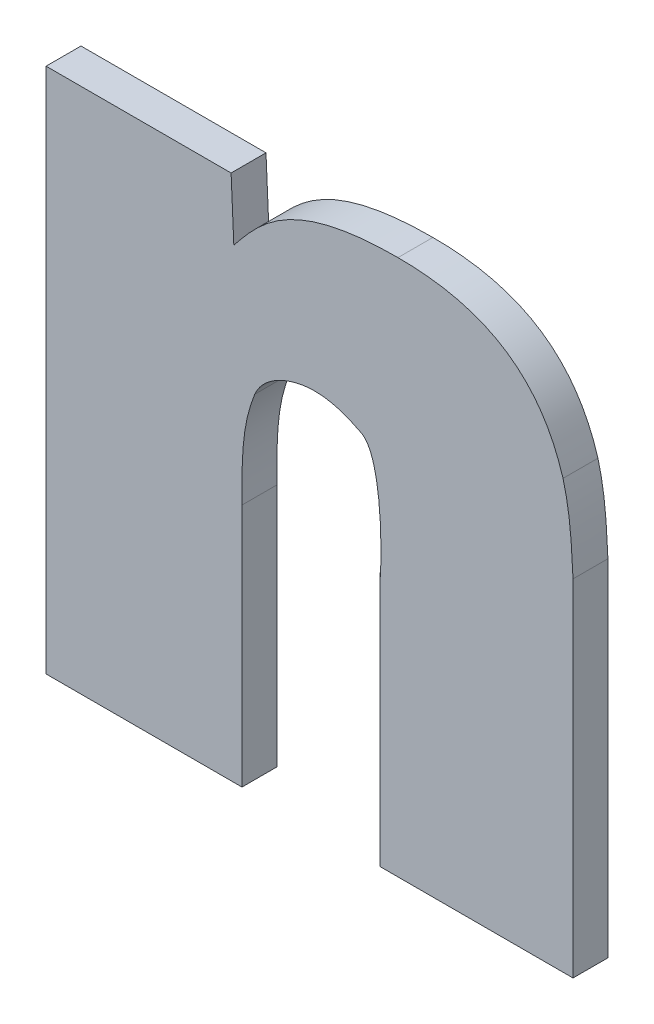
ISO-10303-21;
HEADER;
FILE_DESCRIPTION(('STEP AP214'),'2;1');
FILE_NAME('part.step','',(''),(''),'','','');
FILE_SCHEMA(('AUTOMOTIVE_DESIGN { 1 0 10303 214 1 1 1 1 }'));
ENDSEC;
DATA;
#1=APPLICATION_CONTEXT('core data for automotive mechanical design processes');
#2=APPLICATION_PROTOCOL_DEFINITION('international standard','automotive_design',2000,#1);
#3=PRODUCT_CONTEXT('',#1,'mechanical');
#4=PRODUCT('Part','Part','',(#3));
#5=PRODUCT_RELATED_PRODUCT_CATEGORY('part','',(#4));
#6=PRODUCT_DEFINITION_FORMATION('','',#4);
#7=PRODUCT_DEFINITION_CONTEXT('part definition',#1,'design');
#8=PRODUCT_DEFINITION('design','',#6,#7);
#9=PRODUCT_DEFINITION_SHAPE('','',#8);
#10=(LENGTH_UNIT() NAMED_UNIT(*) SI_UNIT(.MILLI.,.METRE.));
#11=(NAMED_UNIT(*) PLANE_ANGLE_UNIT() SI_UNIT($,.RADIAN.));
#12=(NAMED_UNIT(*) SI_UNIT($,.STERADIAN.) SOLID_ANGLE_UNIT());
#13=UNCERTAINTY_MEASURE_WITH_UNIT(LENGTH_MEASURE(1.E-05),#10,'distance_accuracy_value','');
#14=(GEOMETRIC_REPRESENTATION_CONTEXT(3) GLOBAL_UNCERTAINTY_ASSIGNED_CONTEXT((#13)) GLOBAL_UNIT_ASSIGNED_CONTEXT((#10,
#11,#12)) REPRESENTATION_CONTEXT('',''));
#15=CARTESIAN_POINT('',(0.,0.,0.));
#16=DIRECTION('',(0.,0.,1.));
#17=DIRECTION('',(1.,0.,0.));
#18=AXIS2_PLACEMENT_3D('',#15,#16,#17);
#19=CARTESIAN_POINT('',(-0.00274224861585553,-0.192058480014889,0.));
#20=DIRECTION('',(-1.,0.,0.));
#21=DIRECTION('',(0.,-1.,0.));
#22=AXIS2_PLACEMENT_3D('',#19,#20,#21);
#23=PLANE('',#22);
#24=DIRECTION('',(0.,-1.,0.));
#25=VECTOR('',#24,1.);
#26=CARTESIAN_POINT('',(-0.00274224861585553,-0.192058480014889,0.));
#27=LINE('',#26,#25);
#28=CARTESIAN_POINT('',(-0.00274224861585553,-0.192058480014889,0.));
#29=VERTEX_POINT('',#28);
#30=CARTESIAN_POINT('',(-0.00274224861585553,-0.213912842174517,0.));
#31=VERTEX_POINT('',#30);
#32=EDGE_CURVE('E11',#29,#31,#27,.T.);
#33=ORIENTED_EDGE('',*,*,#32,.T.);
#34=DIRECTION('',(0.,0.,1.));
#35=VECTOR('',#34,1.);
#36=CARTESIAN_POINT('',(-0.00274224861585553,-0.213912842174517,0.));
#37=LINE('',#36,#35);
#38=CARTESIAN_POINT('',(-0.00274224861585553,-0.213912842174517,0.003));
#39=VERTEX_POINT('',#38);
#40=EDGE_CURVE('E24',#31,#39,#37,.T.);
#41=ORIENTED_EDGE('',*,*,#40,.T.);
#42=DIRECTION('',(0.,-1.,0.));
#43=VECTOR('',#42,1.);
#44=CARTESIAN_POINT('',(-0.00274224861585553,-0.192058480014889,0.003));
#45=LINE('',#44,#43);
#46=CARTESIAN_POINT('',(-0.00274224861585553,-0.192058480014889,0.003));
#47=VERTEX_POINT('',#46);
#48=EDGE_CURVE('E142',#47,#39,#45,.T.);
#49=ORIENTED_EDGE('',*,*,#48,.F.);
#50=DIRECTION('',(0.,0.,1.));
#51=VECTOR('',#50,1.);
#52=CARTESIAN_POINT('',(-0.00274224861585553,-0.192058480014889,0.));
#53=LINE('',#52,#51);
#54=EDGE_CURVE('E318',#29,#47,#53,.T.);
#55=ORIENTED_EDGE('',*,*,#54,.F.);
#56=EDGE_LOOP('',(#33,#41,#49,#55));
#57=FACE_BOUND('',#56,.T.);
#58=ADVANCED_FACE('F17',(#57),#23,.T.);
#59=CARTESIAN_POINT('',(-0.00437898165124764,-0.182425098499369,0.));
#60=CARTESIAN_POINT('',(-0.00437898165124764,-0.182425098499369,0.003));
#61=CARTESIAN_POINT('',(-0.00204079567022111,-0.183524051232402,0.));
#62=CARTESIAN_POINT('',(-0.00204079567022111,-0.183524051232402,0.003));
#63=CARTESIAN_POINT('',(-0.00274224737452582,-0.194661669216421,0.));
#64=CARTESIAN_POINT('',(-0.00274224737452582,-0.194661669216421,0.003));
#65=CARTESIAN_POINT('',(-0.00274224861585553,-0.192058480014889,0.));
#66=CARTESIAN_POINT('',(-0.00274224861585553,-0.192058480014889,0.003));
#67=B_SPLINE_SURFACE_WITH_KNOTS('',3,1,((#59,#60),(#61,#62),(#63,#64),(#65,#66)),.UNSPECIFIED.,
.F.,.F.,.F.,(4,4),(2,2),(0.,1.),(0.,0.0003),.UNSPECIFIED.);
#68=CARTESIAN_POINT('',(-0.00437898165124764,-0.182425098499369,0.));
#69=CARTESIAN_POINT('',(-0.00204079567022111,-0.183524051232402,0.));
#70=CARTESIAN_POINT('',(-0.00274224737452582,-0.194661669216421,0.));
#71=CARTESIAN_POINT('',(-0.00274224861585553,-0.192058480014889,0.));
#72=B_SPLINE_CURVE_WITH_KNOTS('',3,(#68,#69,#70,#71),.UNSPECIFIED.,.F.,.F.,(4,4),(0.,1.),.UNSPECIFIED.);
#73=CARTESIAN_POINT('',(-0.00437898165124764,-0.182425098499369,0.));
#74=VERTEX_POINT('',#73);
#75=EDGE_CURVE('E310',#74,#29,#72,.T.);
#76=CARTESIAN_POINT('',(-0.00437898165124764,-0.182425098499369,0.003));
#77=CARTESIAN_POINT('',(-0.00204079567022111,-0.183524051232402,0.003));
#78=CARTESIAN_POINT('',(-0.00274224737452582,-0.194661669216421,0.003));
#79=CARTESIAN_POINT('',(-0.00274224861585553,-0.192058480014889,0.003));
#80=B_SPLINE_CURVE_WITH_KNOTS('',3,(#76,#77,#78,#79),.UNSPECIFIED.,.F.,.F.,(4,4),(0.,1.),.UNSPECIFIED.);
#81=CARTESIAN_POINT('',(-0.00437898165124764,-0.182425098499369,0.003));
#82=VERTEX_POINT('',#81);
#83=EDGE_CURVE('E306',#82,#47,#80,.T.);
#84=DIRECTION('',(0.,0.,1.));
#85=VECTOR('',#84,1.);
#86=CARTESIAN_POINT('',(-0.00437898165124764,-0.182425098499369,0.));
#87=LINE('',#86,#85);
#88=EDGE_CURVE('E300',#74,#82,#87,.T.);
#89=CARTESIAN_POINT('',(-0.00437898165124764,-0.182425098499369,0.));
#90=CARTESIAN_POINT('',(-0.00437898165124764,-0.182425098499369,0.003));
#91=CARTESIAN_POINT('',(-0.00204079567022111,-0.183524051232402,0.));
#92=CARTESIAN_POINT('',(-0.00204079567022111,-0.183524051232402,0.003));
#93=CARTESIAN_POINT('',(-0.00274224737452582,-0.194661669216421,0.));
#94=CARTESIAN_POINT('',(-0.00274224737452582,-0.194661669216421,0.003));
#95=CARTESIAN_POINT('',(-0.00274224861585553,-0.192058480014889,0.));
#96=CARTESIAN_POINT('',(-0.00274224861585553,-0.192058480014889,0.003));
#97=CARTESIAN_POINT('',(-0.00274224872260989,-0.191834605743557,0.));
#98=CARTESIAN_POINT('',(-0.00274224872260989,-0.191834605743557,0.003));
#99=CARTESIAN_POINT('',(-0.00274224882936424,-0.191610731472225,0.));
#100=CARTESIAN_POINT('',(-0.00274224882936424,-0.191610731472225,0.003));
#101=CARTESIAN_POINT('',(-0.0027422489361186,-0.191386857200894,0.));
#102=CARTESIAN_POINT('',(-0.0027422489361186,-0.191386857200894,0.003));
#103=B_SPLINE_SURFACE_WITH_KNOTS('',3,1,((#89,#90),(#91,#92),(#93,#94),(#95,#96),(#97,#98),(#99,
#100),(#101,#102)),.UNSPECIFIED.,.F.,.F.,.F.,(4,3,4),(2,2),(0.,1.,1.086),(0.,0.0003),.UNSPECIFIED.);
#104=ORIENTED_EDGE('',*,*,#75,.T.);
#105=ORIENTED_EDGE('',*,*,#54,.T.);
#106=ORIENTED_EDGE('',*,*,#83,.F.);
#107=ORIENTED_EDGE('',*,*,#88,.F.);
#108=EDGE_LOOP('',(#104,#105,#106,#107));
#109=FACE_BOUND('',#108,.T.);
#110=ADVANCED_FACE('F359',(#109),#103,.T.);
#111=CARTESIAN_POINT('',(-0.00843186579844759,-0.181326156128297,0.));
#112=CARTESIAN_POINT('',(-0.00843186579844759,-0.181326156128297,0.003));
#113=CARTESIAN_POINT('',(-0.00663925627399071,-0.181287178579809,0.));
#114=CARTESIAN_POINT('',(-0.00663925627399071,-0.181287178579809,0.003));
#115=CARTESIAN_POINT('',(-0.0051583846387041,-0.182043194470393,0.));
#116=CARTESIAN_POINT('',(-0.0051583846387041,-0.182043194470393,0.003));
#117=CARTESIAN_POINT('',(-0.00437898165124764,-0.182425098499369,0.));
#118=CARTESIAN_POINT('',(-0.00437898165124764,-0.182425098499369,0.003));
#119=B_SPLINE_SURFACE_WITH_KNOTS('',3,1,((#111,#112),(#113,#114),(#115,#116),(#117,#118)),
.UNSPECIFIED.,.F.,.F.,.F.,(4,4),(2,2),(0.,1.),(0.,0.0003),.UNSPECIFIED.);
#120=CARTESIAN_POINT('',(-0.00843186579844759,-0.181326156128297,0.));
#121=CARTESIAN_POINT('',(-0.00663925627399071,-0.181287178579809,0.));
#122=CARTESIAN_POINT('',(-0.0051583846387041,-0.182043194470393,0.));
#123=CARTESIAN_POINT('',(-0.00437898165124764,-0.182425098499369,0.));
#124=B_SPLINE_CURVE_WITH_KNOTS('',3,(#120,#121,#122,#123),.UNSPECIFIED.,.F.,.F.,(4,4),(0.,1.),.UNSPECIFIED.);
#125=CARTESIAN_POINT('',(-0.00843186579844759,-0.181326156128297,0.));
#126=VERTEX_POINT('',#125);
#127=EDGE_CURVE('E292',#126,#74,#124,.T.);
#128=CARTESIAN_POINT('',(-0.00843186579844759,-0.181326156128297,0.003));
#129=CARTESIAN_POINT('',(-0.00663925627399071,-0.181287178579809,0.003));
#130=CARTESIAN_POINT('',(-0.0051583846387041,-0.182043194470393,0.003));
#131=CARTESIAN_POINT('',(-0.00437898165124764,-0.182425098499369,0.003));
#132=B_SPLINE_CURVE_WITH_KNOTS('',3,(#128,#129,#130,#131),.UNSPECIFIED.,.F.,.F.,(4,4),(0.,1.),.UNSPECIFIED.);
#133=CARTESIAN_POINT('',(-0.00843186579844759,-0.181326156128297,0.003));
#134=VERTEX_POINT('',#133);
#135=EDGE_CURVE('E287',#134,#82,#132,.T.);
#136=DIRECTION('',(0.,0.,1.));
#137=VECTOR('',#136,1.);
#138=CARTESIAN_POINT('',(-0.00843186579844759,-0.181326156128297,0.));
#139=LINE('',#138,#137);
#140=EDGE_CURVE('E281',#126,#134,#139,.T.);
#141=ORIENTED_EDGE('',*,*,#127,.T.);
#142=ORIENTED_EDGE('',*,*,#88,.T.);
#143=ORIENTED_EDGE('',*,*,#135,.F.);
#144=ORIENTED_EDGE('',*,*,#140,.F.);
#145=EDGE_LOOP('',(#141,#142,#143,#144));
#146=FACE_BOUND('',#145,.T.);
#147=ADVANCED_FACE('F356',(#146),#119,.T.);
#148=CARTESIAN_POINT('',(-0.0134979656342683,-0.184147574261929,0.));
#149=CARTESIAN_POINT('',(-0.0134979656342683,-0.184147574261929,0.003));
#150=CARTESIAN_POINT('',(-0.0133130729557002,-0.183720514151418,0.));
#151=CARTESIAN_POINT('',(-0.0133130729557002,-0.183720514151418,0.003));
#152=CARTESIAN_POINT('',(-0.0130453320812846,-0.183340541159043,0.));
#153=CARTESIAN_POINT('',(-0.0130453320812846,-0.183340541159043,0.003));
#154=CARTESIAN_POINT('',(-0.0123851302839423,-0.182669788078298,0.));
#155=CARTESIAN_POINT('',(-0.0123851302839423,-0.182669788078298,0.003));
#156=CARTESIAN_POINT('',(-0.011994902994516,-0.182386006466949,0.));
#157=CARTESIAN_POINT('',(-0.011994902994516,-0.182386006466949,0.003));
#158=CARTESIAN_POINT('',(-0.0111007810286606,-0.181889367272901,0.));
#159=CARTESIAN_POINT('',(-0.0111007810286606,-0.181889367272901,0.003));
#160=CARTESIAN_POINT('',(-0.0105801356724161,-0.181688465209944,0.));
#161=CARTESIAN_POINT('',(-0.0105801356724161,-0.181688465209944,0.003));
#162=CARTESIAN_POINT('',(-0.00952439418704317,-0.181414383581828,0.));
#163=CARTESIAN_POINT('',(-0.00952439418704317,-0.181414383581828,0.003));
#164=CARTESIAN_POINT('',(-0.00897466285186775,-0.181336594439367,0.));
#165=CARTESIAN_POINT('',(-0.00897466285186775,-0.181336594439367,0.003));
#166=CARTESIAN_POINT('',(-0.00843186579844759,-0.181326156128297,0.));
#167=CARTESIAN_POINT('',(-0.00843186579844759,-0.181326156128297,0.003));
#168=B_SPLINE_SURFACE_WITH_KNOTS('',3,1,((#148,#149),(#150,#151),(#152,#153),(#154,#155),(#156,
#157),(#158,#159),(#160,#161),(#162,#163),(#164,#165),(#166,#167)),.UNSPECIFIED.,.F.,.F.,.F.,(4,
2,2,2,4),(2,2),(0.,0.0010389354432012,0.0021009182741266,0.003320279666233,0.004532104245712),
(0.,0.0003),.UNSPECIFIED.);
#169=CARTESIAN_POINT('',(-0.0134979656342683,-0.184147574261929,0.));
#170=CARTESIAN_POINT('',(-0.0133130729557002,-0.183720514151418,0.));
#171=CARTESIAN_POINT('',(-0.0130453320812846,-0.183340541159043,0.));
#172=CARTESIAN_POINT('',(-0.0123851302839423,-0.182669788078298,0.));
#173=CARTESIAN_POINT('',(-0.011994902994516,-0.182386006466949,0.));
#174=CARTESIAN_POINT('',(-0.0111007810286606,-0.181889367272901,0.));
#175=CARTESIAN_POINT('',(-0.0105801356724161,-0.181688465209944,0.));
#176=CARTESIAN_POINT('',(-0.00952439418704317,-0.181414383581828,0.));
#177=CARTESIAN_POINT('',(-0.00897466285186775,-0.181336594439367,0.));
#178=CARTESIAN_POINT('',(-0.00843186579844759,-0.181326156128297,0.));
#179=B_SPLINE_CURVE_WITH_KNOTS('',3,(#169,#170,#171,#172,#173,#174,#175,#176,#177,#178),
.UNSPECIFIED.,.F.,.F.,(4,2,2,2,4),(0.,0.0010389354432012,0.0021009182741266,0.003320279666233,
0.004532104245712),.UNSPECIFIED.);
#180=CARTESIAN_POINT('',(-0.0134979656342683,-0.184147574261929,0.));
#181=VERTEX_POINT('',#180);
#182=EDGE_CURVE('E273',#181,#126,#179,.T.);
#183=CARTESIAN_POINT('',(-0.0134979656342683,-0.184147574261929,0.003));
#184=CARTESIAN_POINT('',(-0.0133130729557002,-0.183720514151418,0.003));
#185=CARTESIAN_POINT('',(-0.0130453320812846,-0.183340541159043,0.003));
#186=CARTESIAN_POINT('',(-0.0123851302839423,-0.182669788078298,0.003));
#187=CARTESIAN_POINT('',(-0.011994902994516,-0.182386006466949,0.003));
#188=CARTESIAN_POINT('',(-0.0111007810286606,-0.181889367272901,0.003));
#189=CARTESIAN_POINT('',(-0.0105801356724161,-0.181688465209944,0.003));
#190=CARTESIAN_POINT('',(-0.00952439418704317,-0.181414383581828,0.003));
#191=CARTESIAN_POINT('',(-0.00897466285186775,-0.181336594439367,0.003));
#192=CARTESIAN_POINT('',(-0.00843186579844759,-0.181326156128297,0.003));
#193=B_SPLINE_CURVE_WITH_KNOTS('',3,(#183,#184,#185,#186,#187,#188,#189,#190,#191,#192),
.UNSPECIFIED.,.F.,.F.,(4,2,2,2,4),(0.,0.0010389354432012,0.0021009182741266,0.003320279666233,
0.004532104245712),.UNSPECIFIED.);
#194=CARTESIAN_POINT('',(-0.0134979656342683,-0.184147574261929,0.003));
#195=VERTEX_POINT('',#194);
#196=EDGE_CURVE('E268',#195,#134,#193,.T.);
#197=DIRECTION('',(0.,0.,1.));
#198=VECTOR('',#197,1.);
#199=CARTESIAN_POINT('',(-0.0134979656342683,-0.184147574261929,0.));
#200=LINE('',#199,#198);
#201=EDGE_CURVE('E262',#181,#195,#200,.T.);
#202=ORIENTED_EDGE('',*,*,#182,.T.);
#203=ORIENTED_EDGE('',*,*,#140,.T.);
#204=ORIENTED_EDGE('',*,*,#196,.F.);
#205=ORIENTED_EDGE('',*,*,#201,.F.);
#206=EDGE_LOOP('',(#202,#203,#204,#205));
#207=FACE_BOUND('',#206,.T.);
#208=ADVANCED_FACE('F353',(#207),#168,.T.);
#209=CARTESIAN_POINT('',(-0.0145891316876444,-0.192939204150313,0.));
#210=CARTESIAN_POINT('',(-0.0145891316876444,-0.192939204150313,0.003));
#211=CARTESIAN_POINT('',(-0.0146670499630458,-0.188364119411759,0.));
#212=CARTESIAN_POINT('',(-0.0146670499630458,-0.188364119411759,0.003));
#213=CARTESIAN_POINT('',(-0.014355312682584,-0.186345480396953,0.));
#214=CARTESIAN_POINT('',(-0.014355312682584,-0.186345480396953,0.003));
#215=CARTESIAN_POINT('',(-0.0134979656342683,-0.184147574261929,0.));
#216=CARTESIAN_POINT('',(-0.0134979656342683,-0.184147574261929,0.003));
#217=B_SPLINE_SURFACE_WITH_KNOTS('',3,1,((#209,#210),(#211,#212),(#213,#214),(#215,#216)),
.UNSPECIFIED.,.F.,.F.,.F.,(4,4),(2,2),(0.,1.),(0.,0.0003),.UNSPECIFIED.);
#218=CARTESIAN_POINT('',(-0.0145891316876444,-0.192939204150313,0.));
#219=CARTESIAN_POINT('',(-0.0146670499630458,-0.188364119411759,0.));
#220=CARTESIAN_POINT('',(-0.014355312682584,-0.186345480396953,0.));
#221=CARTESIAN_POINT('',(-0.0134979656342683,-0.184147574261929,0.));
#222=B_SPLINE_CURVE_WITH_KNOTS('',3,(#218,#219,#220,#221),.UNSPECIFIED.,.F.,.F.,(4,4),(0.,1.),.UNSPECIFIED.);
#223=CARTESIAN_POINT('',(-0.0145891316876444,-0.192939204150313,0.));
#224=VERTEX_POINT('',#223);
#225=EDGE_CURVE('E254',#224,#181,#222,.T.);
#226=CARTESIAN_POINT('',(-0.0145891316876444,-0.192939204150313,0.003));
#227=CARTESIAN_POINT('',(-0.0146670499630458,-0.188364119411759,0.003));
#228=CARTESIAN_POINT('',(-0.014355312682584,-0.186345480396953,0.003));
#229=CARTESIAN_POINT('',(-0.0134979656342683,-0.184147574261929,0.003));
#230=B_SPLINE_CURVE_WITH_KNOTS('',3,(#226,#227,#228,#229),.UNSPECIFIED.,.F.,.F.,(4,4),(0.,1.),.UNSPECIFIED.);
#231=CARTESIAN_POINT('',(-0.0145891316876444,-0.192939204150313,0.003));
#232=VERTEX_POINT('',#231);
#233=EDGE_CURVE('E249',#232,#195,#230,.T.);
#234=DIRECTION('',(0.,0.,1.));
#235=VECTOR('',#234,1.);
#236=CARTESIAN_POINT('',(-0.0145891316876444,-0.192939204150313,0.));
#237=LINE('',#236,#235);
#238=EDGE_CURVE('E246',#224,#232,#237,.T.);
#239=ORIENTED_EDGE('',*,*,#225,.T.);
#240=ORIENTED_EDGE('',*,*,#201,.T.);
#241=ORIENTED_EDGE('',*,*,#233,.F.);
#242=ORIENTED_EDGE('',*,*,#238,.F.);
#243=EDGE_LOOP('',(#239,#240,#241,#242));
#244=FACE_BOUND('',#243,.T.);
#245=ADVANCED_FACE('F350',(#244),#217,.T.);
#246=CARTESIAN_POINT('',(-0.0145891316876444,-0.213928421551029,0.));
#247=DIRECTION('',(1.,0.,0.));
#248=DIRECTION('',(0.,1.,0.));
#249=AXIS2_PLACEMENT_3D('',#246,#247,#248);
#250=PLANE('',#249);
#251=DIRECTION('',(0.,1.,0.));
#252=VECTOR('',#251,1.);
#253=CARTESIAN_POINT('',(-0.0145891316876444,-0.213928421551029,0.));
#254=LINE('',#253,#252);
#255=CARTESIAN_POINT('',(-0.0145891316876444,-0.213928421551029,0.));
#256=VERTEX_POINT('',#255);
#257=EDGE_CURVE('E243',#256,#224,#254,.T.);
#258=ORIENTED_EDGE('',*,*,#257,.T.);
#259=ORIENTED_EDGE('',*,*,#238,.T.);
#260=DIRECTION('',(0.,1.,0.));
#261=VECTOR('',#260,1.);
#262=CARTESIAN_POINT('',(-0.0145891316876444,-0.213928421551029,0.003));
#263=LINE('',#262,#261);
#264=CARTESIAN_POINT('',(-0.0145891316876444,-0.213928421551029,0.003));
#265=VERTEX_POINT('',#264);
#266=EDGE_CURVE('E240',#265,#232,#263,.T.);
#267=ORIENTED_EDGE('',*,*,#266,.F.);
#268=DIRECTION('',(0.,0.,1.));
#269=VECTOR('',#268,1.);
#270=CARTESIAN_POINT('',(-0.0145891316876444,-0.213928421551029,0.));
#271=LINE('',#270,#269);
#272=EDGE_CURVE('E237',#256,#265,#271,.T.);
#273=ORIENTED_EDGE('',*,*,#272,.F.);
#274=EDGE_LOOP('',(#258,#259,#267,#273));
#275=FACE_BOUND('',#274,.T.);
#276=ADVANCED_FACE('F347',(#275),#250,.T.);
#277=CARTESIAN_POINT('',(-0.0314241428373788,-0.213928421551029,0.));
#278=DIRECTION('',(0.,-1.,0.));
#279=DIRECTION('',(1.,0.,0.));
#280=AXIS2_PLACEMENT_3D('',#277,#278,#279);
#281=PLANE('',#280);
#282=DIRECTION('',(1.,0.,0.));
#283=VECTOR('',#282,1.);
#284=CARTESIAN_POINT('',(-0.0314241428373788,-0.213928421551029,0.));
#285=LINE('',#284,#283);
#286=CARTESIAN_POINT('',(-0.0314241428373788,-0.213928421551029,0.));
#287=VERTEX_POINT('',#286);
#288=EDGE_CURVE('E234',#287,#256,#285,.T.);
#289=ORIENTED_EDGE('',*,*,#288,.T.);
#290=ORIENTED_EDGE('',*,*,#272,.T.);
#291=DIRECTION('',(1.,0.,0.));
#292=VECTOR('',#291,1.);
#293=CARTESIAN_POINT('',(-0.0314241428373788,-0.213928421551029,0.003));
#294=LINE('',#293,#292);
#295=CARTESIAN_POINT('',(-0.0314241428373788,-0.213928421551029,0.003));
#296=VERTEX_POINT('',#295);
#297=EDGE_CURVE('E231',#296,#265,#294,.T.);
#298=ORIENTED_EDGE('',*,*,#297,.F.);
#299=DIRECTION('',(0.,0.,1.));
#300=VECTOR('',#299,1.);
#301=CARTESIAN_POINT('',(-0.0314241428373788,-0.213928421551029,0.));
#302=LINE('',#301,#300);
#303=EDGE_CURVE('E228',#287,#296,#302,.T.);
#304=ORIENTED_EDGE('',*,*,#303,.F.);
#305=EDGE_LOOP('',(#289,#290,#298,#304));
#306=FACE_BOUND('',#305,.T.);
#307=ADVANCED_FACE('F344',(#306),#281,.T.);
#308=CARTESIAN_POINT('',(-0.0314241428373788,-0.168692084010721,0.));
#309=DIRECTION('',(-1.,0.,0.));
#310=DIRECTION('',(0.,-1.,0.));
#311=AXIS2_PLACEMENT_3D('',#308,#309,#310);
#312=PLANE('',#311);
#313=DIRECTION('',(0.,-1.,0.));
#314=VECTOR('',#313,1.);
#315=CARTESIAN_POINT('',(-0.0314241428373788,-0.168692084010721,0.));
#316=LINE('',#315,#314);
#317=CARTESIAN_POINT('',(-0.0314241428373788,-0.168692084010721,0.));
#318=VERTEX_POINT('',#317);
#319=EDGE_CURVE('E225',#318,#287,#316,.T.);
#320=ORIENTED_EDGE('',*,*,#319,.T.);
#321=ORIENTED_EDGE('',*,*,#303,.T.);
#322=DIRECTION('',(0.,-1.,0.));
#323=VECTOR('',#322,1.);
#324=CARTESIAN_POINT('',(-0.0314241428373788,-0.168692084010721,0.003));
#325=LINE('',#324,#323);
#326=CARTESIAN_POINT('',(-0.0314241428373788,-0.168692084010721,0.003));
#327=VERTEX_POINT('',#326);
#328=EDGE_CURVE('E222',#327,#296,#325,.T.);
#329=ORIENTED_EDGE('',*,*,#328,.F.);
#330=DIRECTION('',(0.,0.,1.));
#331=VECTOR('',#330,1.);
#332=CARTESIAN_POINT('',(-0.0314241428373788,-0.168692084010721,0.));
#333=LINE('',#332,#331);
#334=EDGE_CURVE('E219',#318,#327,#333,.T.);
#335=ORIENTED_EDGE('',*,*,#334,.F.);
#336=EDGE_LOOP('',(#320,#321,#329,#335));
#337=FACE_BOUND('',#336,.T.);
#338=ADVANCED_FACE('F341',(#337),#312,.T.);
#339=CARTESIAN_POINT('',(-0.0155244130560476,-0.168692084010721,0.));
#340=DIRECTION('',(0.,1.,0.));
#341=DIRECTION('',(-1.,0.,0.));
#342=AXIS2_PLACEMENT_3D('',#339,#340,#341);
#343=PLANE('',#342);
#344=DIRECTION('',(-1.,0.,0.));
#345=VECTOR('',#344,1.);
#346=CARTESIAN_POINT('',(-0.0155244130560476,-0.168692084010721,0.));
#347=LINE('',#346,#345);
#348=CARTESIAN_POINT('',(-0.0155244130560476,-0.168692084010721,0.));
#349=VERTEX_POINT('',#348);
#350=EDGE_CURVE('E216',#349,#318,#347,.T.);
#351=ORIENTED_EDGE('',*,*,#350,.T.);
#352=ORIENTED_EDGE('',*,*,#334,.T.);
#353=DIRECTION('',(-1.,0.,0.));
#354=VECTOR('',#353,1.);
#355=CARTESIAN_POINT('',(-0.0155244130560476,-0.168692084010721,0.003));
#356=LINE('',#355,#354);
#357=CARTESIAN_POINT('',(-0.0155244130560476,-0.168692084010721,0.003));
#358=VERTEX_POINT('',#357);
#359=EDGE_CURVE('E213',#358,#327,#356,.T.);
#360=ORIENTED_EDGE('',*,*,#359,.F.);
#361=DIRECTION('',(0.,0.,1.));
#362=VECTOR('',#361,1.);
#363=CARTESIAN_POINT('',(-0.0155244130560476,-0.168692084010721,0.));
#364=LINE('',#363,#362);
#365=EDGE_CURVE('E210',#349,#358,#364,.T.);
#366=ORIENTED_EDGE('',*,*,#365,.F.);
#367=EDGE_LOOP('',(#351,#352,#360,#366));
#368=FACE_BOUND('',#367,.T.);
#369=ADVANCED_FACE('F338',(#368),#343,.T.);
#370=CARTESIAN_POINT('',(-0.0152905887028123,-0.173945232632584,0.));
#371=DIRECTION('',(0.999010842697859,0.0444672483083314,0.));
#372=DIRECTION('',(-0.0444672483083314,0.999010842697859,0.));
#373=AXIS2_PLACEMENT_3D('',#370,#371,#372);
#374=PLANE('',#373);
#375=DIRECTION('',(-0.0444672483083314,0.999010842697858,0.));
#376=VECTOR('',#375,1.);
#377=CARTESIAN_POINT('',(-0.0152905887028123,-0.173945232632584,0.));
#378=LINE('',#377,#376);
#379=CARTESIAN_POINT('',(-0.0152905887028123,-0.173945232632584,0.));
#380=VERTEX_POINT('',#379);
#381=EDGE_CURVE('E207',#380,#349,#378,.T.);
#382=ORIENTED_EDGE('',*,*,#381,.T.);
#383=ORIENTED_EDGE('',*,*,#365,.T.);
#384=DIRECTION('',(-0.0444672483083314,0.999010842697858,0.));
#385=VECTOR('',#384,1.);
#386=CARTESIAN_POINT('',(-0.0152905887028123,-0.173945232632584,0.003));
#387=LINE('',#386,#385);
#388=CARTESIAN_POINT('',(-0.0152905887028123,-0.173945232632584,0.003));
#389=VERTEX_POINT('',#388);
#390=EDGE_CURVE('E204',#389,#358,#387,.T.);
#391=ORIENTED_EDGE('',*,*,#390,.F.);
#392=DIRECTION('',(0.,0.,1.));
#393=VECTOR('',#392,1.);
#394=CARTESIAN_POINT('',(-0.0152905887028123,-0.173945232632584,0.));
#395=LINE('',#394,#393);
#396=EDGE_CURVE('E198',#380,#389,#395,.T.);
#397=ORIENTED_EDGE('',*,*,#396,.F.);
#398=EDGE_LOOP('',(#382,#383,#391,#397));
#399=FACE_BOUND('',#398,.T.);
#400=ADVANCED_FACE('F335',(#399),#374,.T.);
#401=CARTESIAN_POINT('',(-0.00118346059703947,-0.167819157585889,0.));
#402=CARTESIAN_POINT('',(-0.00118346059703947,-0.167819157585889,0.003));
#403=CARTESIAN_POINT('',(-0.0105362596814645,-0.167819148163471,0.));
#404=CARTESIAN_POINT('',(-0.0105362596814645,-0.167819148163471,0.003));
#405=CARTESIAN_POINT('',(-0.0131082672423949,-0.171271907844721,0.));
#406=CARTESIAN_POINT('',(-0.0131082672423949,-0.171271907844721,0.003));
#407=CARTESIAN_POINT('',(-0.0152905887028123,-0.173945232632584,0.));
#408=CARTESIAN_POINT('',(-0.0152905887028123,-0.173945232632584,0.003));
#409=B_SPLINE_SURFACE_WITH_KNOTS('',3,1,((#401,#402),(#403,#404),(#405,#406),(#407,#408)),
.UNSPECIFIED.,.F.,.F.,.F.,(4,4),(2,2),(0.,1.),(0.,0.0003),.UNSPECIFIED.);
#410=CARTESIAN_POINT('',(-0.00118346059703947,-0.167819157585889,0.));
#411=CARTESIAN_POINT('',(-0.0105362596814645,-0.167819148163471,0.));
#412=CARTESIAN_POINT('',(-0.0131082672423949,-0.171271907844721,0.));
#413=CARTESIAN_POINT('',(-0.0152905887028123,-0.173945232632584,0.));
#414=B_SPLINE_CURVE_WITH_KNOTS('',3,(#410,#411,#412,#413),.UNSPECIFIED.,.F.,.F.,(4,4),(0.,1.),.UNSPECIFIED.);
#415=CARTESIAN_POINT('',(-0.00118346059703947,-0.167819157585889,0.));
#416=VERTEX_POINT('',#415);
#417=EDGE_CURVE('E190',#416,#380,#414,.T.);
#418=CARTESIAN_POINT('',(-0.00118346059703947,-0.167819157585889,0.003));
#419=CARTESIAN_POINT('',(-0.0105362596814645,-0.167819148163471,0.003));
#420=CARTESIAN_POINT('',(-0.0131082672423949,-0.171271907844721,0.003));
#421=CARTESIAN_POINT('',(-0.0152905887028123,-0.173945232632584,0.003));
#422=B_SPLINE_CURVE_WITH_KNOTS('',3,(#418,#419,#420,#421),.UNSPECIFIED.,.F.,.F.,(4,4),(0.,1.),.UNSPECIFIED.);
#423=CARTESIAN_POINT('',(-0.00118346059703947,-0.167819157585889,0.003));
#424=VERTEX_POINT('',#423);
#425=EDGE_CURVE('E185',#424,#389,#422,.T.);
#426=DIRECTION('',(0.,0.,1.));
#427=VECTOR('',#426,1.);
#428=CARTESIAN_POINT('',(-0.00118346059703947,-0.167819157585889,0.));
#429=LINE('',#428,#427);
#430=EDGE_CURVE('E179',#416,#424,#429,.T.);
#431=ORIENTED_EDGE('',*,*,#417,.T.);
#432=ORIENTED_EDGE('',*,*,#396,.T.);
#433=ORIENTED_EDGE('',*,*,#425,.F.);
#434=ORIENTED_EDGE('',*,*,#430,.F.);
#435=EDGE_LOOP('',(#431,#432,#433,#434));
#436=FACE_BOUND('',#435,.T.);
#437=ADVANCED_FACE('F332',(#436),#409,.T.);
#438=CARTESIAN_POINT('',(0.0130016178734884,-0.177156365152648,0.));
#439=CARTESIAN_POINT('',(0.0130016178734884,-0.177156365152648,0.003));
#440=CARTESIAN_POINT('',(0.0108972408343461,-0.170211891821846,0.));
#441=CARTESIAN_POINT('',(0.0108972408343461,-0.170211891821846,0.003));
#442=CARTESIAN_POINT('',(0.00567526230728147,-0.167819144105384,0.));
#443=CARTESIAN_POINT('',(0.00567526230728147,-0.167819144105384,0.003));
#444=CARTESIAN_POINT('',(-0.00118346059703947,-0.167819157585889,0.));
#445=CARTESIAN_POINT('',(-0.00118346059703947,-0.167819157585889,0.003));
#446=B_SPLINE_SURFACE_WITH_KNOTS('',3,1,((#438,#439),(#440,#441),(#442,#443),(#444,#445)),
.UNSPECIFIED.,.F.,.F.,.F.,(4,4),(2,2),(0.,1.),(0.,0.0003),.UNSPECIFIED.);
#447=CARTESIAN_POINT('',(0.0130016178734884,-0.177156365152648,0.));
#448=CARTESIAN_POINT('',(0.0108972408343461,-0.170211891821846,0.));
#449=CARTESIAN_POINT('',(0.00567526230728147,-0.167819144105384,0.));
#450=CARTESIAN_POINT('',(-0.00118346059703947,-0.167819157585889,0.));
#451=B_SPLINE_CURVE_WITH_KNOTS('',3,(#447,#448,#449,#450),.UNSPECIFIED.,.F.,.F.,(4,4),(0.,1.),.UNSPECIFIED.);
#452=CARTESIAN_POINT('',(0.0130016178734884,-0.177156365152648,0.));
#453=VERTEX_POINT('',#452);
#454=EDGE_CURVE('E171',#453,#416,#451,.T.);
#455=CARTESIAN_POINT('',(0.0130016178734884,-0.177156365152648,0.003));
#456=CARTESIAN_POINT('',(0.0108972408343461,-0.170211891821846,0.003));
#457=CARTESIAN_POINT('',(0.00567526230728147,-0.167819144105384,0.003));
#458=CARTESIAN_POINT('',(-0.00118346059703947,-0.167819157585889,0.003));
#459=B_SPLINE_CURVE_WITH_KNOTS('',3,(#455,#456,#457,#458),.UNSPECIFIED.,.F.,.F.,(4,4),(0.,1.),.UNSPECIFIED.);
#460=CARTESIAN_POINT('',(0.0130016178734884,-0.177156365152648,0.003));
#461=VERTEX_POINT('',#460);
#462=EDGE_CURVE('E166',#461,#424,#459,.T.);
#463=DIRECTION('',(0.,0.,1.));
#464=VECTOR('',#463,1.);
#465=CARTESIAN_POINT('',(0.0130016178734884,-0.177156365152648,0.));
#466=LINE('',#465,#464);
#467=EDGE_CURVE('E160',#453,#461,#466,.T.);
#468=ORIENTED_EDGE('',*,*,#454,.T.);
#469=ORIENTED_EDGE('',*,*,#430,.T.);
#470=ORIENTED_EDGE('',*,*,#462,.F.);
#471=ORIENTED_EDGE('',*,*,#467,.F.);
#472=EDGE_LOOP('',(#468,#469,#470,#471));
#473=FACE_BOUND('',#472,.T.);
#474=ADVANCED_FACE('F329',(#473),#446,.T.);
#475=CARTESIAN_POINT('',(0.0138589488771364,-0.184209939901993,0.));
#476=CARTESIAN_POINT('',(0.0138589488771364,-0.184209939901993,0.003));
#477=CARTESIAN_POINT('',(0.0137030695404722,-0.180609103692002,0.));
#478=CARTESIAN_POINT('',(0.0137030695404722,-0.180609103692002,0.003));
#479=CARTESIAN_POINT('',(0.0134692505354256,-0.178910021061217,0.));
#480=CARTESIAN_POINT('',(0.0134692505354256,-0.178910021061217,0.003));
#481=CARTESIAN_POINT('',(0.0130016178734884,-0.177156365152648,0.));
#482=CARTESIAN_POINT('',(0.0130016178734884,-0.177156365152648,0.003));
#483=B_SPLINE_SURFACE_WITH_KNOTS('',3,1,((#475,#476),(#477,#478),(#479,#480),(#481,#482)),
.UNSPECIFIED.,.F.,.F.,.F.,(4,4),(2,2),(0.,1.),(0.,0.0003),.UNSPECIFIED.);
#484=CARTESIAN_POINT('',(0.0138589488771364,-0.184209939901993,0.));
#485=CARTESIAN_POINT('',(0.0137030695404722,-0.180609103692002,0.));
#486=CARTESIAN_POINT('',(0.0134692505354256,-0.178910021061217,0.));
#487=CARTESIAN_POINT('',(0.0130016178734884,-0.177156365152648,0.));
#488=B_SPLINE_CURVE_WITH_KNOTS('',3,(#484,#485,#486,#487),.UNSPECIFIED.,.F.,.F.,(4,4),(0.,1.),.UNSPECIFIED.);
#489=CARTESIAN_POINT('',(0.0138589488771364,-0.184209939901993,0.));
#490=VERTEX_POINT('',#489);
#491=EDGE_CURVE('E152',#490,#453,#488,.T.);
#492=CARTESIAN_POINT('',(0.0138589488771364,-0.184209939901993,0.003));
#493=CARTESIAN_POINT('',(0.0137030695404722,-0.180609103692002,0.003));
#494=CARTESIAN_POINT('',(0.0134692505354256,-0.178910021061217,0.003));
#495=CARTESIAN_POINT('',(0.0130016178734884,-0.177156365152648,0.003));
#496=B_SPLINE_CURVE_WITH_KNOTS('',3,(#492,#493,#494,#495),.UNSPECIFIED.,.F.,.F.,(4,4),(0.,1.),.UNSPECIFIED.);
#497=CARTESIAN_POINT('',(0.0138589488771364,-0.184209939901993,0.003));
#498=VERTEX_POINT('',#497);
#499=EDGE_CURVE('E148',#498,#461,#496,.T.);
#500=DIRECTION('',(0.,0.,1.));
#501=VECTOR('',#500,1.);
#502=CARTESIAN_POINT('',(0.0138589488771364,-0.184209939901993,0.));
#503=LINE('',#502,#501);
#504=EDGE_CURVE('E127',#490,#498,#503,.T.);
#505=ORIENTED_EDGE('',*,*,#491,.T.);
#506=ORIENTED_EDGE('',*,*,#467,.T.);
#507=ORIENTED_EDGE('',*,*,#499,.F.);
#508=ORIENTED_EDGE('',*,*,#504,.F.);
#509=EDGE_LOOP('',(#505,#506,#507,#508));
#510=FACE_BOUND('',#509,.T.);
#511=ADVANCED_FACE('F327',(#510),#483,.T.);
#512=CARTESIAN_POINT('',(0.0138589488771364,-0.213912842174517,0.));
#513=DIRECTION('',(1.,0.,0.));
#514=DIRECTION('',(0.,1.,0.));
#515=AXIS2_PLACEMENT_3D('',#512,#513,#514);
#516=PLANE('',#515);
#517=DIRECTION('',(0.,1.,0.));
#518=VECTOR('',#517,1.);
#519=CARTESIAN_POINT('',(0.0138589488771364,-0.213912842174517,0.));
#520=LINE('',#519,#518);
#521=CARTESIAN_POINT('',(0.0138589488771364,-0.213912842174517,0.));
#522=VERTEX_POINT('',#521);
#523=EDGE_CURVE('E131',#522,#490,#520,.T.);
#524=ORIENTED_EDGE('',*,*,#523,.T.);
#525=ORIENTED_EDGE('',*,*,#504,.T.);
#526=DIRECTION('',(0.,1.,0.));
#527=VECTOR('',#526,1.);
#528=CARTESIAN_POINT('',(0.0138589488771364,-0.213912842174517,0.003));
#529=LINE('',#528,#527);
#530=CARTESIAN_POINT('',(0.0138589488771364,-0.213912842174517,0.003));
#531=VERTEX_POINT('',#530);
#532=EDGE_CURVE('E120',#531,#498,#529,.T.);
#533=ORIENTED_EDGE('',*,*,#532,.F.);
#534=DIRECTION('',(0.,0.,1.));
#535=VECTOR('',#534,1.);
#536=CARTESIAN_POINT('',(0.0138589488771364,-0.213912842174517,0.));
#537=LINE('',#536,#535);
#538=EDGE_CURVE('E124',#522,#531,#537,.T.);
#539=ORIENTED_EDGE('',*,*,#538,.F.);
#540=EDGE_LOOP('',(#524,#525,#533,#539));
#541=FACE_BOUND('',#540,.T.);
#542=ADVANCED_FACE('F123',(#541),#516,.T.);
#543=CARTESIAN_POINT('',(-0.00274224861585553,-0.213912842174517,0.));
#544=DIRECTION('',(0.,-1.,0.));
#545=DIRECTION('',(1.,0.,0.));
#546=AXIS2_PLACEMENT_3D('',#543,#544,#545);
#547=PLANE('',#546);
#548=DIRECTION('',(1.,0.,0.));
#549=VECTOR('',#548,1.);
#550=CARTESIAN_POINT('',(-0.00274224861585553,-0.213912842174517,0.));
#551=LINE('',#550,#549);
#552=EDGE_CURVE('E137',#31,#522,#551,.T.);
#553=ORIENTED_EDGE('',*,*,#552,.T.);
#554=ORIENTED_EDGE('',*,*,#538,.T.);
#555=DIRECTION('',(1.,0.,0.));
#556=VECTOR('',#555,1.);
#557=CARTESIAN_POINT('',(-0.00274224861585553,-0.213912842174517,0.003));
#558=LINE('',#557,#556);
#559=EDGE_CURVE('E136',#39,#531,#558,.T.);
#560=ORIENTED_EDGE('',*,*,#559,.F.);
#561=ORIENTED_EDGE('',*,*,#40,.F.);
#562=EDGE_LOOP('',(#553,#554,#560,#561));
#563=FACE_BOUND('',#562,.T.);
#564=ADVANCED_FACE('F135',(#563),#547,.T.);
#565=CARTESIAN_POINT('',(-0.00878259698012119,-0.190873782828206,0.003));
#566=DIRECTION('',(0.,0.,1.));
#567=DIRECTION('',(1.,0.,0.));
#568=AXIS2_PLACEMENT_3D('',#565,#566,#567);
#569=PLANE('',#568);
#570=ORIENTED_EDGE('',*,*,#559,.T.);
#571=ORIENTED_EDGE('',*,*,#532,.T.);
#572=ORIENTED_EDGE('',*,*,#499,.T.);
#573=ORIENTED_EDGE('',*,*,#462,.T.);
#574=ORIENTED_EDGE('',*,*,#425,.T.);
#575=ORIENTED_EDGE('',*,*,#390,.T.);
#576=ORIENTED_EDGE('',*,*,#359,.T.);
#577=ORIENTED_EDGE('',*,*,#328,.T.);
#578=ORIENTED_EDGE('',*,*,#297,.T.);
#579=ORIENTED_EDGE('',*,*,#266,.T.);
#580=ORIENTED_EDGE('',*,*,#233,.T.);
#581=ORIENTED_EDGE('',*,*,#196,.T.);
#582=ORIENTED_EDGE('',*,*,#135,.T.);
#583=ORIENTED_EDGE('',*,*,#83,.T.);
#584=ORIENTED_EDGE('',*,*,#48,.T.);
#585=EDGE_LOOP('',(#570,#571,#572,#573,#574,#575,#576,#577,#578,#579,#580,#581,#582,#583,#584));
#586=FACE_BOUND('',#585,.T.);
#587=ADVANCED_FACE('F140',(#586),#569,.T.);
#588=CARTESIAN_POINT('',(-0.00878259698012119,-0.190873782828206,0.));
#589=DIRECTION('',(0.,0.,1.));
#590=DIRECTION('',(1.,0.,0.));
#591=AXIS2_PLACEMENT_3D('',#588,#589,#590);
#592=PLANE('',#591);
#593=ORIENTED_EDGE('',*,*,#552,.F.);
#594=ORIENTED_EDGE('',*,*,#32,.F.);
#595=ORIENTED_EDGE('',*,*,#75,.F.);
#596=ORIENTED_EDGE('',*,*,#127,.F.);
#597=ORIENTED_EDGE('',*,*,#182,.F.);
#598=ORIENTED_EDGE('',*,*,#225,.F.);
#599=ORIENTED_EDGE('',*,*,#257,.F.);
#600=ORIENTED_EDGE('',*,*,#288,.F.);
#601=ORIENTED_EDGE('',*,*,#319,.F.);
#602=ORIENTED_EDGE('',*,*,#350,.F.);
#603=ORIENTED_EDGE('',*,*,#381,.F.);
#604=ORIENTED_EDGE('',*,*,#417,.F.);
#605=ORIENTED_EDGE('',*,*,#454,.F.);
#606=ORIENTED_EDGE('',*,*,#491,.F.);
#607=ORIENTED_EDGE('',*,*,#523,.F.);
#608=EDGE_LOOP('',(#593,#594,#595,#596,#597,#598,#599,#600,#601,#602,#603,#604,#605,#606,#607));
#609=FACE_BOUND('',#608,.T.);
#610=ADVANCED_FACE('F324',(#609),#592,.F.);
#611=CLOSED_SHELL('',(#58,#110,#147,#208,#245,#276,#307,#338,#369,#400,#437,#474,#511,#542,#564,
#587,#610));
#612=MANIFOLD_SOLID_BREP('B1',#611);
#613=ADVANCED_BREP_SHAPE_REPRESENTATION('',(#18,#612),#14);
#614=SHAPE_DEFINITION_REPRESENTATION(#9,#613);
ENDSEC;
END-ISO-10303-21;
